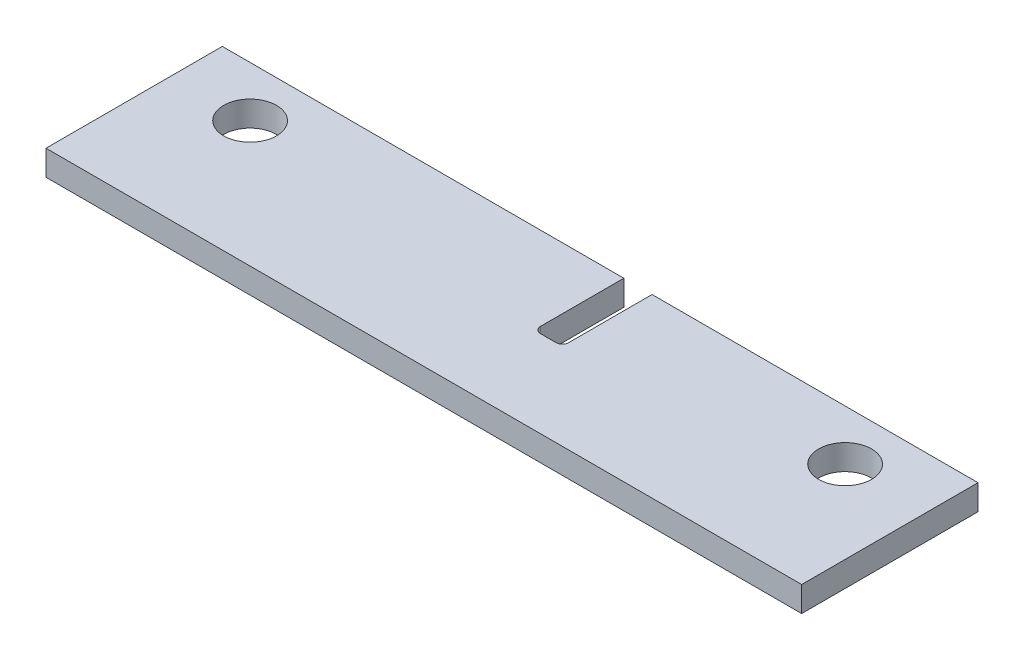
ISO-10303-21;
HEADER;
FILE_DESCRIPTION(('STEP AP214'),'2;1');
FILE_NAME('part.step','',(''),(''),'','','');
FILE_SCHEMA(('AUTOMOTIVE_DESIGN { 1 0 10303 214 1 1 1 1 }'));
ENDSEC;
DATA;
#1=APPLICATION_CONTEXT('core data for automotive mechanical design processes');
#2=APPLICATION_PROTOCOL_DEFINITION('international standard','automotive_design',2000,#1);
#3=PRODUCT_CONTEXT('',#1,'mechanical');
#4=PRODUCT('Part','Part','',(#3));
#5=PRODUCT_RELATED_PRODUCT_CATEGORY('part','',(#4));
#6=PRODUCT_DEFINITION_FORMATION('','',#4);
#7=PRODUCT_DEFINITION_CONTEXT('part definition',#1,'design');
#8=PRODUCT_DEFINITION('design','',#6,#7);
#9=PRODUCT_DEFINITION_SHAPE('','',#8);
#10=(LENGTH_UNIT() NAMED_UNIT(*) SI_UNIT(.MILLI.,.METRE.));
#11=(NAMED_UNIT(*) PLANE_ANGLE_UNIT() SI_UNIT($,.RADIAN.));
#12=(NAMED_UNIT(*) SI_UNIT($,.STERADIAN.) SOLID_ANGLE_UNIT());
#13=UNCERTAINTY_MEASURE_WITH_UNIT(LENGTH_MEASURE(1.E-05),#10,'distance_accuracy_value','');
#14=(GEOMETRIC_REPRESENTATION_CONTEXT(3) GLOBAL_UNCERTAINTY_ASSIGNED_CONTEXT((#13)) GLOBAL_UNIT_ASSIGNED_CONTEXT((#10,
#11,#12)) REPRESENTATION_CONTEXT('',''));
#15=CARTESIAN_POINT('',(0.,0.,0.));
#16=DIRECTION('',(0.,0.,1.));
#17=DIRECTION('',(1.,0.,0.));
#18=AXIS2_PLACEMENT_3D('',#15,#16,#17);
#19=CARTESIAN_POINT('',(0.,0.,249.6));
#20=DIRECTION('',(0.,0.,-1.));
#21=DIRECTION('',(-1.,0.,0.));
#22=AXIS2_PLACEMENT_3D('',#19,#20,#21);
#23=PLANE('',#22);
#24=DIRECTION('',(0.,1.,0.));
#25=VECTOR('',#24,1.);
#26=CARTESIAN_POINT('',(2477.262,115.8,249.6));
#27=LINE('',#26,#25);
#28=CARTESIAN_POINT('',(2477.262,115.8,249.6));
#29=VERTEX_POINT('',#28);
#30=CARTESIAN_POINT('',(2477.262,128.5,249.6));
#31=VERTEX_POINT('',#30);
#32=EDGE_CURVE('E155',#29,#31,#27,.T.);
#33=ORIENTED_EDGE('',*,*,#32,.T.);
#34=DIRECTION('',(-1.,0.,0.));
#35=VECTOR('',#34,1.);
#36=CARTESIAN_POINT('',(2260.6,128.5,249.6));
#37=LINE('',#36,#35);
#38=CARTESIAN_POINT('',(2641.6,128.5,249.6));
#39=VERTEX_POINT('',#38);
#40=EDGE_CURVE('E133',#39,#31,#37,.T.);
#41=ORIENTED_EDGE('',*,*,#40,.F.);
#42=DIRECTION('',(0.,1.,0.));
#43=VECTOR('',#42,1.);
#44=CARTESIAN_POINT('',(2641.6,115.8,249.6));
#45=LINE('',#44,#43);
#46=CARTESIAN_POINT('',(2641.6,115.8,249.6));
#47=VERTEX_POINT('',#46);
#48=EDGE_CURVE('E180',#47,#39,#45,.T.);
#49=ORIENTED_EDGE('',*,*,#48,.F.);
#50=DIRECTION('',(1.,0.,0.));
#51=VECTOR('',#50,1.);
#52=CARTESIAN_POINT('',(2260.6,115.8,249.6));
#53=LINE('',#52,#51);
#54=EDGE_CURVE('E203',#29,#47,#53,.T.);
#55=ORIENTED_EDGE('',*,*,#54,.F.);
#56=EDGE_LOOP('',(#33,#41,#49,#55));
#57=FACE_BOUND('',#56,.T.);
#58=ADVANCED_FACE('F44',(#57),#23,.T.);
#59=CARTESIAN_POINT('',(2260.6,115.8,249.6));
#60=DIRECTION('',(-1.,0.,0.));
#61=DIRECTION('',(0.,0.,1.));
#62=AXIS2_PLACEMENT_3D('',#59,#60,#61);
#63=PLANE('',#62);
#64=DIRECTION('',(0.,0.,1.));
#65=VECTOR('',#64,1.);
#66=CARTESIAN_POINT('',(2260.6,115.8,249.6));
#67=LINE('',#66,#65);
#68=CARTESIAN_POINT('',(2260.6,115.8,249.6));
#69=VERTEX_POINT('',#68);
#70=CARTESIAN_POINT('',(2260.6,115.8,338.5));
#71=VERTEX_POINT('',#70);
#72=EDGE_CURVE('E149',#69,#71,#67,.T.);
#73=ORIENTED_EDGE('',*,*,#72,.T.);
#74=DIRECTION('',(0.,-1.,0.));
#75=VECTOR('',#74,1.);
#76=CARTESIAN_POINT('',(2260.6,115.8,338.5));
#77=LINE('',#76,#75);
#78=CARTESIAN_POINT('',(2260.6,128.5,338.5));
#79=VERTEX_POINT('',#78);
#80=EDGE_CURVE('E140',#79,#71,#77,.T.);
#81=ORIENTED_EDGE('',*,*,#80,.F.);
#82=DIRECTION('',(0.,0.,1.));
#83=VECTOR('',#82,1.);
#84=CARTESIAN_POINT('',(2260.6,128.5,249.6));
#85=LINE('',#84,#83);
#86=CARTESIAN_POINT('',(2260.6,128.5,249.6));
#87=VERTEX_POINT('',#86);
#88=EDGE_CURVE('E124',#87,#79,#85,.T.);
#89=ORIENTED_EDGE('',*,*,#88,.F.);
#90=DIRECTION('',(0.,-1.,0.));
#91=VECTOR('',#90,1.);
#92=CARTESIAN_POINT('',(2260.6,115.8,249.6));
#93=LINE('',#92,#91);
#94=EDGE_CURVE('E138',#87,#69,#93,.T.);
#95=ORIENTED_EDGE('',*,*,#94,.T.);
#96=EDGE_LOOP('',(#73,#81,#89,#95));
#97=FACE_BOUND('',#96,.T.);
#98=ADVANCED_FACE('F137',(#97),#63,.T.);
#99=CARTESIAN_POINT('',(2260.6,128.5,249.6));
#100=DIRECTION('',(0.,1.,0.));
#101=DIRECTION('',(0.,0.,1.));
#102=AXIS2_PLACEMENT_3D('',#99,#100,#101);
#103=PLANE('',#102);
#104=CARTESIAN_POINT('',(2599.99999999996,128.5,275.));
#105=DIRECTION('',(0.,1.,0.));
#106=DIRECTION('',(0.,0.,1.));
#107=AXIS2_PLACEMENT_3D('',#104,#105,#106);
#108=CIRCLE('',#107,13.3349999999999);
#109=CARTESIAN_POINT('',(2599.99999999996,128.5,261.665));
#110=VERTEX_POINT('',#109);
#111=EDGE_CURVE('E148',#110,#110,#108,.F.);
#112=ORIENTED_EDGE('',*,*,#111,.T.);
#113=EDGE_LOOP('',(#112));
#114=FACE_BOUND('',#113,.T.);
#115=CARTESIAN_POINT('',(2299.99999999996,128.5,275.));
#116=DIRECTION('',(0.,1.,0.));
#117=DIRECTION('',(0.,0.,1.));
#118=AXIS2_PLACEMENT_3D('',#115,#116,#117);
#119=CIRCLE('',#118,13.3349999999999);
#120=CARTESIAN_POINT('',(2299.99999999996,128.5,261.665));
#121=VERTEX_POINT('',#120);
#122=EDGE_CURVE('E131',#121,#121,#119,.F.);
#123=ORIENTED_EDGE('',*,*,#122,.T.);
#124=EDGE_LOOP('',(#123));
#125=FACE_BOUND('',#124,.T.);
#126=DIRECTION('',(0.,0.,-1.));
#127=VECTOR('',#126,1.);
#128=CARTESIAN_POINT('',(2477.262,128.5,249.6));
#129=LINE('',#128,#127);
#130=CARTESIAN_POINT('',(2477.262,128.5,291.637));
#131=VERTEX_POINT('',#130);
#132=EDGE_CURVE('E163',#131,#31,#129,.T.);
#133=ORIENTED_EDGE('',*,*,#132,.F.);
#134=CARTESIAN_POINT('',(2474.087,128.5,291.637));
#135=DIRECTION('',(0.,1.,0.));
#136=DIRECTION('',(0.,0.,1.));
#137=AXIS2_PLACEMENT_3D('',#134,#135,#136);
#138=CIRCLE('',#137,3.175);
#139=CARTESIAN_POINT('',(2474.087,128.5,294.812));
#140=VERTEX_POINT('',#139);
#141=EDGE_CURVE('E224',#131,#140,#138,.F.);
#142=ORIENTED_EDGE('',*,*,#141,.T.);
#143=DIRECTION('',(1.,0.,0.));
#144=VECTOR('',#143,1.);
#145=CARTESIAN_POINT('',(2260.6,128.5,294.812000000001));
#146=LINE('',#145,#144);
#147=CARTESIAN_POINT('',(2466.213,128.5,294.812));
#148=VERTEX_POINT('',#147);
#149=EDGE_CURVE('E191',#148,#140,#146,.T.);
#150=ORIENTED_EDGE('',*,*,#149,.F.);
#151=CARTESIAN_POINT('',(2466.213,128.5,291.637));
#152=DIRECTION('',(0.,1.,0.));
#153=DIRECTION('',(0.,0.,1.));
#154=AXIS2_PLACEMENT_3D('',#151,#152,#153);
#155=CIRCLE('',#154,3.175);
#156=CARTESIAN_POINT('',(2463.038,128.5,291.637));
#157=VERTEX_POINT('',#156);
#158=EDGE_CURVE('E53',#148,#157,#155,.F.);
#159=ORIENTED_EDGE('',*,*,#158,.T.);
#160=DIRECTION('',(0.,0.,1.));
#161=VECTOR('',#160,1.);
#162=CARTESIAN_POINT('',(2463.038,128.5,249.6));
#163=LINE('',#162,#161);
#164=CARTESIAN_POINT('',(2463.038,128.5,249.6));
#165=VERTEX_POINT('',#164);
#166=EDGE_CURVE('E126',#165,#157,#163,.T.);
#167=ORIENTED_EDGE('',*,*,#166,.F.);
#168=EDGE_CURVE('E119',#165,#87,#37,.T.);
#169=ORIENTED_EDGE('',*,*,#168,.T.);
#170=ORIENTED_EDGE('',*,*,#88,.T.);
#171=DIRECTION('',(-1.,0.,0.));
#172=VECTOR('',#171,1.);
#173=CARTESIAN_POINT('',(2260.6,128.5,338.5));
#174=LINE('',#173,#172);
#175=CARTESIAN_POINT('',(2641.6,128.5,338.5));
#176=VERTEX_POINT('',#175);
#177=EDGE_CURVE('E160',#176,#79,#174,.T.);
#178=ORIENTED_EDGE('',*,*,#177,.F.);
#179=DIRECTION('',(0.,0.,1.));
#180=VECTOR('',#179,1.);
#181=CARTESIAN_POINT('',(2641.6,128.5,249.6));
#182=LINE('',#181,#180);
#183=EDGE_CURVE('E238',#39,#176,#182,.T.);
#184=ORIENTED_EDGE('',*,*,#183,.F.);
#185=ORIENTED_EDGE('',*,*,#40,.T.);
#186=EDGE_LOOP('',(#133,#142,#150,#159,#167,#169,#170,#178,#184,#185));
#187=FACE_BOUND('',#186,.T.);
#188=ADVANCED_FACE('F122',(#114,#125,#187),#103,.T.);
#189=CARTESIAN_POINT('',(2641.6,115.8,249.6));
#190=DIRECTION('',(1.,0.,0.));
#191=DIRECTION('',(0.,0.,-1.));
#192=AXIS2_PLACEMENT_3D('',#189,#190,#191);
#193=PLANE('',#192);
#194=ORIENTED_EDGE('',*,*,#183,.T.);
#195=DIRECTION('',(0.,1.,0.));
#196=VECTOR('',#195,1.);
#197=CARTESIAN_POINT('',(2641.6,115.8,338.5));
#198=LINE('',#197,#196);
#199=CARTESIAN_POINT('',(2641.6,115.8,338.5));
#200=VERTEX_POINT('',#199);
#201=EDGE_CURVE('E164',#200,#176,#198,.T.);
#202=ORIENTED_EDGE('',*,*,#201,.F.);
#203=DIRECTION('',(0.,0.,1.));
#204=VECTOR('',#203,1.);
#205=CARTESIAN_POINT('',(2641.6,115.8,249.6));
#206=LINE('',#205,#204);
#207=EDGE_CURVE('E232',#47,#200,#206,.T.);
#208=ORIENTED_EDGE('',*,*,#207,.F.);
#209=ORIENTED_EDGE('',*,*,#48,.T.);
#210=EDGE_LOOP('',(#194,#202,#208,#209));
#211=FACE_BOUND('',#210,.T.);
#212=ADVANCED_FACE('F290',(#211),#193,.T.);
#213=CARTESIAN_POINT('',(2260.6,115.8,249.6));
#214=DIRECTION('',(0.,-1.,0.));
#215=DIRECTION('',(0.,0.,-1.));
#216=AXIS2_PLACEMENT_3D('',#213,#214,#215);
#217=PLANE('',#216);
#218=CARTESIAN_POINT('',(2599.99999999996,115.8,275.));
#219=DIRECTION('',(0.,-1.,0.));
#220=DIRECTION('',(0.,0.,-1.));
#221=AXIS2_PLACEMENT_3D('',#218,#219,#220);
#222=CIRCLE('',#221,13.3349999999999);
#223=CARTESIAN_POINT('',(2599.99999999996,115.8,261.665));
#224=VERTEX_POINT('',#223);
#225=EDGE_CURVE('E175',#224,#224,#222,.F.);
#226=ORIENTED_EDGE('',*,*,#225,.T.);
#227=EDGE_LOOP('',(#226));
#228=FACE_BOUND('',#227,.T.);
#229=CARTESIAN_POINT('',(2299.99999999996,115.8,275.));
#230=DIRECTION('',(0.,-1.,0.));
#231=DIRECTION('',(0.,0.,-1.));
#232=AXIS2_PLACEMENT_3D('',#229,#230,#231);
#233=CIRCLE('',#232,13.3349999999999);
#234=CARTESIAN_POINT('',(2299.99999999996,115.8,261.665));
#235=VERTEX_POINT('',#234);
#236=EDGE_CURVE('E179',#235,#235,#233,.F.);
#237=ORIENTED_EDGE('',*,*,#236,.T.);
#238=EDGE_LOOP('',(#237));
#239=FACE_BOUND('',#238,.T.);
#240=DIRECTION('',(1.,0.,0.));
#241=VECTOR('',#240,1.);
#242=CARTESIAN_POINT('',(2476.5,115.8,294.812));
#243=LINE('',#242,#241);
#244=CARTESIAN_POINT('',(2466.213,115.8,294.812));
#245=VERTEX_POINT('',#244);
#246=CARTESIAN_POINT('',(2474.087,115.8,294.812));
#247=VERTEX_POINT('',#246);
#248=EDGE_CURVE('E173',#245,#247,#243,.T.);
#249=ORIENTED_EDGE('',*,*,#248,.T.);
#250=CARTESIAN_POINT('',(2474.087,115.8,291.637));
#251=DIRECTION('',(0.,-1.,0.));
#252=DIRECTION('',(0.,0.,-1.));
#253=AXIS2_PLACEMENT_3D('',#250,#251,#252);
#254=CIRCLE('',#253,3.175);
#255=CARTESIAN_POINT('',(2477.262,115.8,291.637));
#256=VERTEX_POINT('',#255);
#257=EDGE_CURVE('E227',#247,#256,#254,.F.);
#258=ORIENTED_EDGE('',*,*,#257,.T.);
#259=DIRECTION('',(0.,0.,-1.));
#260=VECTOR('',#259,1.);
#261=CARTESIAN_POINT('',(2477.262,115.8,249.6));
#262=LINE('',#261,#260);
#263=EDGE_CURVE('E187',#256,#29,#262,.T.);
#264=ORIENTED_EDGE('',*,*,#263,.T.);
#265=ORIENTED_EDGE('',*,*,#54,.T.);
#266=ORIENTED_EDGE('',*,*,#207,.T.);
#267=DIRECTION('',(1.,0.,0.));
#268=VECTOR('',#267,1.);
#269=CARTESIAN_POINT('',(2260.6,115.8,338.5));
#270=LINE('',#269,#268);
#271=EDGE_CURVE('E168',#71,#200,#270,.T.);
#272=ORIENTED_EDGE('',*,*,#271,.F.);
#273=ORIENTED_EDGE('',*,*,#72,.F.);
#274=CARTESIAN_POINT('',(2463.038,115.8,249.6));
#275=VERTEX_POINT('',#274);
#276=EDGE_CURVE('E146',#69,#275,#53,.T.);
#277=ORIENTED_EDGE('',*,*,#276,.T.);
#278=DIRECTION('',(0.,0.,1.));
#279=VECTOR('',#278,1.);
#280=CARTESIAN_POINT('',(2463.038,115.8,294.05));
#281=LINE('',#280,#279);
#282=CARTESIAN_POINT('',(2463.038,115.8,291.637));
#283=VERTEX_POINT('',#282);
#284=EDGE_CURVE('E195',#275,#283,#281,.T.);
#285=ORIENTED_EDGE('',*,*,#284,.T.);
#286=CARTESIAN_POINT('',(2466.213,115.8,291.637));
#287=DIRECTION('',(0.,-1.,0.));
#288=DIRECTION('',(0.,0.,-1.));
#289=AXIS2_PLACEMENT_3D('',#286,#287,#288);
#290=CIRCLE('',#289,3.175);
#291=EDGE_CURVE('E12',#283,#245,#290,.F.);
#292=ORIENTED_EDGE('',*,*,#291,.T.);
#293=EDGE_LOOP('',(#249,#258,#264,#265,#266,#272,#273,#277,#285,#292));
#294=FACE_BOUND('',#293,.T.);
#295=ADVANCED_FACE('F262',(#228,#239,#294),#217,.T.);
#296=DIRECTION('',(0.,1.,0.));
#297=VECTOR('',#296,1.);
#298=CARTESIAN_POINT('',(2463.038,0.,249.6));
#299=LINE('',#298,#297);
#300=EDGE_CURVE('E190',#275,#165,#299,.T.);
#301=ORIENTED_EDGE('',*,*,#300,.F.);
#302=ORIENTED_EDGE('',*,*,#276,.F.);
#303=ORIENTED_EDGE('',*,*,#94,.F.);
#304=ORIENTED_EDGE('',*,*,#168,.F.);
#305=EDGE_LOOP('',(#301,#302,#303,#304));
#306=FACE_BOUND('',#305,.T.);
#307=ADVANCED_FACE('F144',(#306),#23,.T.);
#308=CARTESIAN_POINT('',(0.,0.,338.5));
#309=DIRECTION('',(0.,0.,-1.));
#310=DIRECTION('',(-1.,0.,0.));
#311=AXIS2_PLACEMENT_3D('',#308,#309,#310);
#312=PLANE('',#311);
#313=ORIENTED_EDGE('',*,*,#80,.T.);
#314=ORIENTED_EDGE('',*,*,#271,.T.);
#315=ORIENTED_EDGE('',*,*,#201,.T.);
#316=ORIENTED_EDGE('',*,*,#177,.T.);
#317=EDGE_LOOP('',(#313,#314,#315,#316));
#318=FACE_BOUND('',#317,.T.);
#319=ADVANCED_FACE('F284',(#318),#312,.F.);
#320=CARTESIAN_POINT('',(2477.262,115.8,249.6));
#321=DIRECTION('',(1.,0.,0.));
#322=DIRECTION('',(0.,0.,-1.));
#323=AXIS2_PLACEMENT_3D('',#320,#321,#322);
#324=PLANE('',#323);
#325=ORIENTED_EDGE('',*,*,#263,.F.);
#326=DIRECTION('',(0.,1.,0.));
#327=VECTOR('',#326,1.);
#328=CARTESIAN_POINT('',(2477.262,128.5,291.637));
#329=LINE('',#328,#327);
#330=EDGE_CURVE('E194',#256,#131,#329,.T.);
#331=ORIENTED_EDGE('',*,*,#330,.T.);
#332=ORIENTED_EDGE('',*,*,#132,.T.);
#333=ORIENTED_EDGE('',*,*,#32,.F.);
#334=EDGE_LOOP('',(#325,#331,#332,#333));
#335=FACE_BOUND('',#334,.T.);
#336=ADVANCED_FACE('F249',(#335),#324,.F.);
#337=CARTESIAN_POINT('',(2476.5,115.8,294.812));
#338=DIRECTION('',(0.,0.,1.));
#339=DIRECTION('',(1.,0.,0.));
#340=AXIS2_PLACEMENT_3D('',#337,#338,#339);
#341=PLANE('',#340);
#342=ORIENTED_EDGE('',*,*,#149,.T.);
#343=DIRECTION('',(0.,1.,0.));
#344=VECTOR('',#343,1.);
#345=CARTESIAN_POINT('',(2474.087,115.8,294.812));
#346=LINE('',#345,#344);
#347=EDGE_CURVE('E219',#140,#247,#346,.F.);
#348=ORIENTED_EDGE('',*,*,#347,.T.);
#349=ORIENTED_EDGE('',*,*,#248,.F.);
#350=DIRECTION('',(0.,1.,0.));
#351=VECTOR('',#350,1.);
#352=CARTESIAN_POINT('',(2466.213,128.5,294.812));
#353=LINE('',#352,#351);
#354=EDGE_CURVE('E215',#245,#148,#353,.T.);
#355=ORIENTED_EDGE('',*,*,#354,.T.);
#356=EDGE_LOOP('',(#342,#348,#349,#355));
#357=FACE_BOUND('',#356,.T.);
#358=ADVANCED_FACE('F256',(#357),#341,.F.);
#359=CARTESIAN_POINT('',(2463.038,115.8,294.05));
#360=DIRECTION('',(-1.,0.,0.));
#361=DIRECTION('',(0.,0.,1.));
#362=AXIS2_PLACEMENT_3D('',#359,#360,#361);
#363=PLANE('',#362);
#364=ORIENTED_EDGE('',*,*,#166,.T.);
#365=DIRECTION('',(0.,1.,0.));
#366=VECTOR('',#365,1.);
#367=CARTESIAN_POINT('',(2463.038,115.8,291.637));
#368=LINE('',#367,#366);
#369=EDGE_CURVE('E60',#157,#283,#368,.F.);
#370=ORIENTED_EDGE('',*,*,#369,.T.);
#371=ORIENTED_EDGE('',*,*,#284,.F.);
#372=ORIENTED_EDGE('',*,*,#300,.T.);
#373=EDGE_LOOP('',(#364,#370,#371,#372));
#374=FACE_BOUND('',#373,.T.);
#375=ADVANCED_FACE('F263',(#374),#363,.F.);
#376=CARTESIAN_POINT('',(2299.99999999996,181.249999999996,275.));
#377=DIRECTION('',(0.,-1.,0.));
#378=DIRECTION('',(0.,0.,-1.));
#379=AXIS2_PLACEMENT_3D('',#376,#377,#378);
#380=CYLINDRICAL_SURFACE('',#379,13.3349999999999);
#381=CARTESIAN_POINT('',(2299.99999999996,128.5,261.665));
#382=CARTESIAN_POINT('',(2299.99999999996,128.367708333333,261.665));
#383=CARTESIAN_POINT('',(2299.99999999996,128.235416666667,261.665));
#384=CARTESIAN_POINT('',(2299.99999999996,127.970833333333,261.665));
#385=CARTESIAN_POINT('',(2299.99999999996,127.838541666667,261.665));
#386=CARTESIAN_POINT('',(2299.99999999996,127.573958333333,261.665));
#387=CARTESIAN_POINT('',(2299.99999999996,127.441666666667,261.665));
#388=CARTESIAN_POINT('',(2299.99999999996,127.177083333333,261.665));
#389=CARTESIAN_POINT('',(2299.99999999996,127.044791666667,261.665));
#390=CARTESIAN_POINT('',(2299.99999999996,126.780208333333,261.665));
#391=CARTESIAN_POINT('',(2299.99999999996,126.647916666667,261.665));
#392=CARTESIAN_POINT('',(2299.99999999996,126.383333333333,261.665));
#393=CARTESIAN_POINT('',(2299.99999999996,126.251041666667,261.665));
#394=CARTESIAN_POINT('',(2299.99999999996,125.986458333333,261.665));
#395=CARTESIAN_POINT('',(2299.99999999996,125.854166666667,261.665));
#396=CARTESIAN_POINT('',(2299.99999999996,125.589583333333,261.665));
#397=CARTESIAN_POINT('',(2299.99999999996,125.457291666667,261.665));
#398=CARTESIAN_POINT('',(2299.99999999996,125.192708333333,261.665));
#399=CARTESIAN_POINT('',(2299.99999999996,125.060416666667,261.665));
#400=CARTESIAN_POINT('',(2299.99999999996,124.795833333333,261.665));
#401=CARTESIAN_POINT('',(2299.99999999996,124.663541666667,261.665));
#402=CARTESIAN_POINT('',(2299.99999999996,124.398958333333,261.665));
#403=CARTESIAN_POINT('',(2299.99999999996,124.266666666667,261.665));
#404=CARTESIAN_POINT('',(2299.99999999996,124.002083333333,261.665));
#405=CARTESIAN_POINT('',(2299.99999999996,123.869791666667,261.665));
#406=CARTESIAN_POINT('',(2299.99999999996,123.605208333333,261.665));
#407=CARTESIAN_POINT('',(2299.99999999996,123.472916666667,261.665));
#408=CARTESIAN_POINT('',(2299.99999999996,123.208333333333,261.665));
#409=CARTESIAN_POINT('',(2299.99999999996,123.076041666667,261.665));
#410=CARTESIAN_POINT('',(2299.99999999996,122.811458333333,261.665));
#411=CARTESIAN_POINT('',(2299.99999999996,122.679166666667,261.665));
#412=CARTESIAN_POINT('',(2299.99999999996,122.414583333333,261.665));
#413=CARTESIAN_POINT('',(2299.99999999996,122.282291666667,261.665));
#414=CARTESIAN_POINT('',(2299.99999999996,122.017708333333,261.665));
#415=CARTESIAN_POINT('',(2299.99999999996,121.885416666667,261.665));
#416=CARTESIAN_POINT('',(2299.99999999996,121.620833333333,261.665));
#417=CARTESIAN_POINT('',(2299.99999999996,121.488541666667,261.665));
#418=CARTESIAN_POINT('',(2299.99999999996,121.223958333333,261.665));
#419=CARTESIAN_POINT('',(2299.99999999996,121.091666666667,261.665));
#420=CARTESIAN_POINT('',(2299.99999999996,120.827083333333,261.665));
#421=CARTESIAN_POINT('',(2299.99999999996,120.694791666667,261.665));
#422=CARTESIAN_POINT('',(2299.99999999996,120.430208333333,261.665));
#423=CARTESIAN_POINT('',(2299.99999999996,120.297916666667,261.665));
#424=CARTESIAN_POINT('',(2299.99999999996,120.033333333333,261.665));
#425=CARTESIAN_POINT('',(2299.99999999996,119.901041666667,261.665));
#426=CARTESIAN_POINT('',(2299.99999999996,119.636458333333,261.665));
#427=CARTESIAN_POINT('',(2299.99999999996,119.504166666667,261.665));
#428=CARTESIAN_POINT('',(2299.99999999996,119.239583333333,261.665));
#429=CARTESIAN_POINT('',(2299.99999999996,119.107291666667,261.665));
#430=CARTESIAN_POINT('',(2299.99999999996,118.842708333333,261.665));
#431=CARTESIAN_POINT('',(2299.99999999996,118.710416666667,261.665));
#432=CARTESIAN_POINT('',(2299.99999999996,118.445833333333,261.665));
#433=CARTESIAN_POINT('',(2299.99999999996,118.313541666667,261.665));
#434=CARTESIAN_POINT('',(2299.99999999996,118.048958333333,261.665));
#435=CARTESIAN_POINT('',(2299.99999999996,117.916666666667,261.665));
#436=CARTESIAN_POINT('',(2299.99999999996,117.652083333333,261.665));
#437=CARTESIAN_POINT('',(2299.99999999996,117.519791666667,261.665));
#438=CARTESIAN_POINT('',(2299.99999999996,117.255208333333,261.665));
#439=CARTESIAN_POINT('',(2299.99999999996,117.122916666667,261.665));
#440=CARTESIAN_POINT('',(2299.99999999996,116.858333333333,261.665));
#441=CARTESIAN_POINT('',(2299.99999999996,116.726041666667,261.665));
#442=CARTESIAN_POINT('',(2299.99999999996,116.461458333333,261.665));
#443=CARTESIAN_POINT('',(2299.99999999996,116.329166666667,261.665));
#444=CARTESIAN_POINT('',(2299.99999999996,116.064583333333,261.665));
#445=CARTESIAN_POINT('',(2299.99999999996,115.932291666667,261.665));
#446=CARTESIAN_POINT('',(2299.99999999996,115.8,261.665));
#447=B_SPLINE_CURVE_WITH_KNOTS('',3,(#381,#382,#383,#384,#385,#386,#387,#388,#389,#390,#391,
#392,#393,#394,#395,#396,#397,#398,#399,#400,#401,#402,#403,#404,#405,#406,#407,#408,#409,#410,
#411,#412,#413,#414,#415,#416,#417,#418,#419,#420,#421,#422,#423,#424,#425,#426,#427,#428,#429,
#430,#431,#432,#433,#434,#435,#436,#437,#438,#439,#440,#441,#442,#443,#444,#445,#446),
.UNSPECIFIED.,.F.,.F.,(4,2,2,2,2,2,2,2,2,2,2,2,2,2,2,2,2,2,2,2,2,2,2,2,2,2,2,2,2,2,2,2,4),(0.,
0.396874999999991,0.793749999999982,1.190625,1.58749999999999,1.98437499999998,2.38124999999997,
2.77812499999996,3.17499999999998,3.57187499999997,3.96874999999998,4.36562499999998,
4.76249999999998,5.15937499999998,5.55624999999998,5.95312499999998,6.34999999999997,
6.74687499999997,7.14374999999998,7.54062499999997,7.93749999999997,8.33437499999998,
8.73124999999997,9.12812499999996,9.52499999999996,9.92187499999997,10.31875,10.715625,11.1125,
11.509375,11.90625,12.303125,12.7),.UNSPECIFIED.);
#448=EDGE_CURVE('BSEAM265',#121,#235,#447,.T.);
#449=ORIENTED_EDGE('',*,*,#122,.F.);
#450=ORIENTED_EDGE('',*,*,#236,.F.);
#451=ORIENTED_EDGE('',*,*,#448,.T.);
#452=ORIENTED_EDGE('',*,*,#448,.F.);
#453=EDGE_LOOP('',(#449,#451,#450,#452));
#454=FACE_BOUND('',#453,.T.);
#455=ADVANCED_FACE('F265',(#454),#380,.F.);
#456=CARTESIAN_POINT('',(2599.99999999996,289.999999999996,275.));
#457=DIRECTION('',(0.,-1.,0.));
#458=DIRECTION('',(0.,0.,-1.));
#459=AXIS2_PLACEMENT_3D('',#456,#457,#458);
#460=CYLINDRICAL_SURFACE('',#459,13.3349999999999);
#461=CARTESIAN_POINT('',(2599.99999999996,128.5,261.665));
#462=CARTESIAN_POINT('',(2599.99999999996,128.367708333333,261.665));
#463=CARTESIAN_POINT('',(2599.99999999996,128.235416666667,261.665));
#464=CARTESIAN_POINT('',(2599.99999999996,127.970833333333,261.665));
#465=CARTESIAN_POINT('',(2599.99999999996,127.838541666667,261.665));
#466=CARTESIAN_POINT('',(2599.99999999996,127.573958333333,261.665));
#467=CARTESIAN_POINT('',(2599.99999999996,127.441666666667,261.665));
#468=CARTESIAN_POINT('',(2599.99999999996,127.177083333333,261.665));
#469=CARTESIAN_POINT('',(2599.99999999996,127.044791666667,261.665));
#470=CARTESIAN_POINT('',(2599.99999999996,126.780208333333,261.665));
#471=CARTESIAN_POINT('',(2599.99999999996,126.647916666667,261.665));
#472=CARTESIAN_POINT('',(2599.99999999996,126.383333333333,261.665));
#473=CARTESIAN_POINT('',(2599.99999999996,126.251041666667,261.665));
#474=CARTESIAN_POINT('',(2599.99999999996,125.986458333333,261.665));
#475=CARTESIAN_POINT('',(2599.99999999996,125.854166666667,261.665));
#476=CARTESIAN_POINT('',(2599.99999999996,125.589583333333,261.665));
#477=CARTESIAN_POINT('',(2599.99999999996,125.457291666667,261.665));
#478=CARTESIAN_POINT('',(2599.99999999996,125.192708333333,261.665));
#479=CARTESIAN_POINT('',(2599.99999999996,125.060416666667,261.665));
#480=CARTESIAN_POINT('',(2599.99999999996,124.795833333333,261.665));
#481=CARTESIAN_POINT('',(2599.99999999996,124.663541666667,261.665));
#482=CARTESIAN_POINT('',(2599.99999999996,124.398958333333,261.665));
#483=CARTESIAN_POINT('',(2599.99999999996,124.266666666667,261.665));
#484=CARTESIAN_POINT('',(2599.99999999996,124.002083333333,261.665));
#485=CARTESIAN_POINT('',(2599.99999999996,123.869791666667,261.665));
#486=CARTESIAN_POINT('',(2599.99999999996,123.605208333333,261.665));
#487=CARTESIAN_POINT('',(2599.99999999996,123.472916666667,261.665));
#488=CARTESIAN_POINT('',(2599.99999999996,123.208333333333,261.665));
#489=CARTESIAN_POINT('',(2599.99999999996,123.076041666667,261.665));
#490=CARTESIAN_POINT('',(2599.99999999996,122.811458333333,261.665));
#491=CARTESIAN_POINT('',(2599.99999999996,122.679166666667,261.665));
#492=CARTESIAN_POINT('',(2599.99999999996,122.414583333333,261.665));
#493=CARTESIAN_POINT('',(2599.99999999996,122.282291666667,261.665));
#494=CARTESIAN_POINT('',(2599.99999999996,122.017708333333,261.665));
#495=CARTESIAN_POINT('',(2599.99999999996,121.885416666667,261.665));
#496=CARTESIAN_POINT('',(2599.99999999996,121.620833333333,261.665));
#497=CARTESIAN_POINT('',(2599.99999999996,121.488541666667,261.665));
#498=CARTESIAN_POINT('',(2599.99999999996,121.223958333333,261.665));
#499=CARTESIAN_POINT('',(2599.99999999996,121.091666666667,261.665));
#500=CARTESIAN_POINT('',(2599.99999999996,120.827083333333,261.665));
#501=CARTESIAN_POINT('',(2599.99999999996,120.694791666667,261.665));
#502=CARTESIAN_POINT('',(2599.99999999996,120.430208333333,261.665));
#503=CARTESIAN_POINT('',(2599.99999999996,120.297916666667,261.665));
#504=CARTESIAN_POINT('',(2599.99999999996,120.033333333333,261.665));
#505=CARTESIAN_POINT('',(2599.99999999996,119.901041666667,261.665));
#506=CARTESIAN_POINT('',(2599.99999999996,119.636458333333,261.665));
#507=CARTESIAN_POINT('',(2599.99999999996,119.504166666667,261.665));
#508=CARTESIAN_POINT('',(2599.99999999996,119.239583333333,261.665));
#509=CARTESIAN_POINT('',(2599.99999999996,119.107291666667,261.665));
#510=CARTESIAN_POINT('',(2599.99999999996,118.842708333333,261.665));
#511=CARTESIAN_POINT('',(2599.99999999996,118.710416666667,261.665));
#512=CARTESIAN_POINT('',(2599.99999999996,118.445833333333,261.665));
#513=CARTESIAN_POINT('',(2599.99999999996,118.313541666667,261.665));
#514=CARTESIAN_POINT('',(2599.99999999996,118.048958333333,261.665));
#515=CARTESIAN_POINT('',(2599.99999999996,117.916666666667,261.665));
#516=CARTESIAN_POINT('',(2599.99999999996,117.652083333333,261.665));
#517=CARTESIAN_POINT('',(2599.99999999996,117.519791666667,261.665));
#518=CARTESIAN_POINT('',(2599.99999999996,117.255208333333,261.665));
#519=CARTESIAN_POINT('',(2599.99999999996,117.122916666667,261.665));
#520=CARTESIAN_POINT('',(2599.99999999996,116.858333333333,261.665));
#521=CARTESIAN_POINT('',(2599.99999999996,116.726041666667,261.665));
#522=CARTESIAN_POINT('',(2599.99999999996,116.461458333333,261.665));
#523=CARTESIAN_POINT('',(2599.99999999996,116.329166666667,261.665));
#524=CARTESIAN_POINT('',(2599.99999999996,116.064583333333,261.665));
#525=CARTESIAN_POINT('',(2599.99999999996,115.932291666667,261.665));
#526=CARTESIAN_POINT('',(2599.99999999996,115.8,261.665));
#527=B_SPLINE_CURVE_WITH_KNOTS('',3,(#461,#462,#463,#464,#465,#466,#467,#468,#469,#470,#471,
#472,#473,#474,#475,#476,#477,#478,#479,#480,#481,#482,#483,#484,#485,#486,#487,#488,#489,#490,
#491,#492,#493,#494,#495,#496,#497,#498,#499,#500,#501,#502,#503,#504,#505,#506,#507,#508,#509,
#510,#511,#512,#513,#514,#515,#516,#517,#518,#519,#520,#521,#522,#523,#524,#525,#526),
.UNSPECIFIED.,.F.,.F.,(4,2,2,2,2,2,2,2,2,2,2,2,2,2,2,2,2,2,2,2,2,2,2,2,2,2,2,2,2,2,2,2,4),(0.,
0.396874999999991,0.79375000000001,1.190625,1.58749999999999,1.98437500000001,2.38125,
2.77812499999999,3.17499999999998,3.571875,3.96874999999999,4.36562499999998,4.7625,
5.15937499999999,5.55624999999998,5.953125,6.34999999999999,6.74687499999999,7.14375,7.540625,
7.93749999999999,8.334375,8.73125,9.12812499999999,9.52500000000001,9.921875,10.31875,10.715625,
11.1125,11.509375,11.90625,12.303125,12.7),.UNSPECIFIED.);
#528=EDGE_CURVE('BSEAM271',#110,#224,#527,.T.);
#529=ORIENTED_EDGE('',*,*,#111,.F.);
#530=ORIENTED_EDGE('',*,*,#225,.F.);
#531=ORIENTED_EDGE('',*,*,#528,.T.);
#532=ORIENTED_EDGE('',*,*,#528,.F.);
#533=EDGE_LOOP('',(#529,#531,#530,#532));
#534=FACE_BOUND('',#533,.T.);
#535=ADVANCED_FACE('F271',(#534),#460,.F.);
#536=CARTESIAN_POINT('',(2474.087,115.8,291.637));
#537=DIRECTION('',(0.,-1.,0.));
#538=DIRECTION('',(0.,0.,-1.));
#539=AXIS2_PLACEMENT_3D('',#536,#537,#538);
#540=CYLINDRICAL_SURFACE('',#539,3.175);
#541=ORIENTED_EDGE('',*,*,#257,.F.);
#542=ORIENTED_EDGE('',*,*,#347,.F.);
#543=ORIENTED_EDGE('',*,*,#141,.F.);
#544=ORIENTED_EDGE('',*,*,#330,.F.);
#545=EDGE_LOOP('',(#541,#542,#543,#544));
#546=FACE_BOUND('',#545,.T.);
#547=ADVANCED_FACE('F253',(#546),#540,.F.);
#548=CARTESIAN_POINT('',(2466.213,115.8,291.637));
#549=DIRECTION('',(0.,-1.,0.));
#550=DIRECTION('',(0.,0.,-1.));
#551=AXIS2_PLACEMENT_3D('',#548,#549,#550);
#552=CYLINDRICAL_SURFACE('',#551,3.175);
#553=ORIENTED_EDGE('',*,*,#291,.F.);
#554=ORIENTED_EDGE('',*,*,#369,.F.);
#555=ORIENTED_EDGE('',*,*,#158,.F.);
#556=ORIENTED_EDGE('',*,*,#354,.F.);
#557=EDGE_LOOP('',(#553,#554,#555,#556));
#558=FACE_BOUND('',#557,.T.);
#559=ADVANCED_FACE('F46',(#558),#552,.F.);
#560=CLOSED_SHELL('',(#58,#98,#188,#212,#295,#307,#319,#336,#358,#375,#455,#535,#547,#559));
#561=MANIFOLD_SOLID_BREP('B2',#560);
#562=ADVANCED_BREP_SHAPE_REPRESENTATION('',(#18,#561),#14);
#563=SHAPE_DEFINITION_REPRESENTATION(#9,#562);
ENDSEC;
END-ISO-10303-21;
